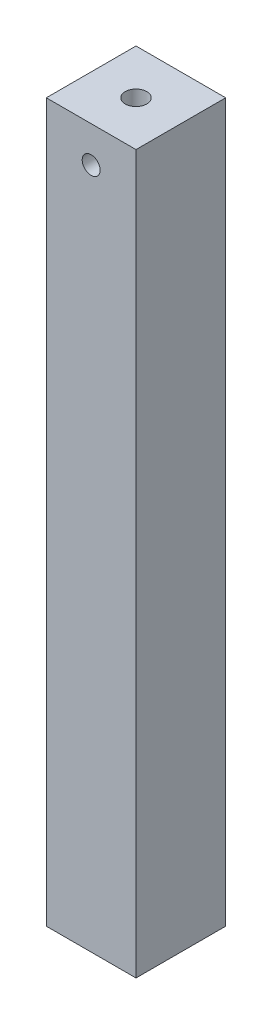
ISO-10303-21;
HEADER;
FILE_DESCRIPTION(('STEP AP214'),'2;1');
FILE_NAME('part.step','',(''),(''),'','','');
FILE_SCHEMA(('AUTOMOTIVE_DESIGN { 1 0 10303 214 1 1 1 1 }'));
ENDSEC;
DATA;
#1=APPLICATION_CONTEXT('core data for automotive mechanical design processes');
#2=APPLICATION_PROTOCOL_DEFINITION('international standard','automotive_design',2000,#1);
#3=PRODUCT_CONTEXT('',#1,'mechanical');
#4=PRODUCT('Part','Part','',(#3));
#5=PRODUCT_RELATED_PRODUCT_CATEGORY('part','',(#4));
#6=PRODUCT_DEFINITION_FORMATION('','',#4);
#7=PRODUCT_DEFINITION_CONTEXT('part definition',#1,'design');
#8=PRODUCT_DEFINITION('design','',#6,#7);
#9=PRODUCT_DEFINITION_SHAPE('','',#8);
#10=(LENGTH_UNIT() NAMED_UNIT(*) SI_UNIT(.MILLI.,.METRE.));
#11=(NAMED_UNIT(*) PLANE_ANGLE_UNIT() SI_UNIT($,.RADIAN.));
#12=(NAMED_UNIT(*) SI_UNIT($,.STERADIAN.) SOLID_ANGLE_UNIT());
#13=UNCERTAINTY_MEASURE_WITH_UNIT(LENGTH_MEASURE(1.E-05),#10,'distance_accuracy_value','');
#14=(GEOMETRIC_REPRESENTATION_CONTEXT(3) GLOBAL_UNCERTAINTY_ASSIGNED_CONTEXT((#13)) GLOBAL_UNIT_ASSIGNED_CONTEXT((#10,
#11,#12)) REPRESENTATION_CONTEXT('',''));
#15=CARTESIAN_POINT('',(0.,0.,0.));
#16=DIRECTION('',(0.,0.,1.));
#17=DIRECTION('',(1.,0.,0.));
#18=AXIS2_PLACEMENT_3D('',#15,#16,#17);
#19=CARTESIAN_POINT('',(0.,200.,0.));
#20=DIRECTION('',(0.,1.,0.));
#21=DIRECTION('',(0.,0.,1.));
#22=AXIS2_PLACEMENT_3D('',#19,#20,#21);
#23=PLANE('',#22);
#24=DIRECTION('',(0.,0.,-1.));
#25=VECTOR('',#24,1.);
#26=CARTESIAN_POINT('',(5.08620689655172,200.,14.8275862068966));
#27=LINE('',#26,#25);
#28=CARTESIAN_POINT('',(5.08620689655172,200.,14.8275862068966));
#29=VERTEX_POINT('',#28);
#30=CARTESIAN_POINT('',(5.08620689655172,200.,-10.1724137931034));
#31=VERTEX_POINT('',#30);
#32=EDGE_CURVE('E96',#29,#31,#27,.T.);
#33=ORIENTED_EDGE('',*,*,#32,.T.);
#34=DIRECTION('',(-1.,0.,0.));
#35=VECTOR('',#34,1.);
#36=CARTESIAN_POINT('',(5.08620689655172,200.,-10.1724137931034));
#37=LINE('',#36,#35);
#38=CARTESIAN_POINT('',(-19.9137931034483,200.,-10.1724137931034));
#39=VERTEX_POINT('',#38);
#40=EDGE_CURVE('E91',#31,#39,#37,.T.);
#41=ORIENTED_EDGE('',*,*,#40,.T.);
#42=DIRECTION('',(0.,0.,1.));
#43=VECTOR('',#42,1.);
#44=CARTESIAN_POINT('',(-19.9137931034483,200.,14.8275862068966));
#45=LINE('',#44,#43);
#46=CARTESIAN_POINT('',(-19.9137931034483,200.,14.8275862068966));
#47=VERTEX_POINT('',#46);
#48=EDGE_CURVE('E94',#39,#47,#45,.T.);
#49=ORIENTED_EDGE('',*,*,#48,.T.);
#50=DIRECTION('',(1.,0.,0.));
#51=VECTOR('',#50,1.);
#52=CARTESIAN_POINT('',(5.08620689655172,200.,14.8275862068966));
#53=LINE('',#52,#51);
#54=EDGE_CURVE('E61',#47,#29,#53,.T.);
#55=ORIENTED_EDGE('',*,*,#54,.T.);
#56=EDGE_LOOP('',(#33,#41,#49,#55));
#57=FACE_BOUND('',#56,.T.);
#58=CARTESIAN_POINT('',(-7.41379310344828,200.,2.32758620689655));
#59=DIRECTION('',(0.,1.,0.));
#60=DIRECTION('',(0.,0.,1.));
#61=AXIS2_PLACEMENT_3D('',#58,#59,#60);
#62=CIRCLE('',#61,3.);
#63=CARTESIAN_POINT('',(-7.41379310344828,200.,5.32758620689655));
#64=VERTEX_POINT('',#63);
#65=EDGE_CURVE('E112',#64,#64,#62,.T.);
#66=ORIENTED_EDGE('',*,*,#65,.F.);
#67=EDGE_LOOP('',(#66));
#68=FACE_BOUND('',#67,.T.);
#69=ADVANCED_FACE('F37',(#57,#68),#23,.T.);
#70=CARTESIAN_POINT('',(0.,0.,0.));
#71=DIRECTION('',(0.,1.,0.));
#72=DIRECTION('',(0.,0.,1.));
#73=AXIS2_PLACEMENT_3D('',#70,#71,#72);
#74=PLANE('',#73);
#75=DIRECTION('',(0.,0.,-1.));
#76=VECTOR('',#75,1.);
#77=CARTESIAN_POINT('',(5.08620689655172,0.,14.8275862068966));
#78=LINE('',#77,#76);
#79=CARTESIAN_POINT('',(5.08620689655172,0.,14.8275862068966));
#80=VERTEX_POINT('',#79);
#81=CARTESIAN_POINT('',(5.08620689655172,0.,-10.1724137931034));
#82=VERTEX_POINT('',#81);
#83=EDGE_CURVE('E109',#80,#82,#78,.T.);
#84=ORIENTED_EDGE('',*,*,#83,.F.);
#85=DIRECTION('',(1.,0.,0.));
#86=VECTOR('',#85,1.);
#87=CARTESIAN_POINT('',(5.08620689655172,0.,14.8275862068966));
#88=LINE('',#87,#86);
#89=CARTESIAN_POINT('',(-19.9137931034483,0.,14.8275862068966));
#90=VERTEX_POINT('',#89);
#91=EDGE_CURVE('E84',#90,#80,#88,.T.);
#92=ORIENTED_EDGE('',*,*,#91,.F.);
#93=DIRECTION('',(0.,0.,1.));
#94=VECTOR('',#93,1.);
#95=CARTESIAN_POINT('',(-19.9137931034483,0.,14.8275862068966));
#96=LINE('',#95,#94);
#97=CARTESIAN_POINT('',(-19.9137931034483,0.,-10.1724137931034));
#98=VERTEX_POINT('',#97);
#99=EDGE_CURVE('E78',#98,#90,#96,.T.);
#100=ORIENTED_EDGE('',*,*,#99,.F.);
#101=DIRECTION('',(-1.,0.,0.));
#102=VECTOR('',#101,1.);
#103=CARTESIAN_POINT('',(5.08620689655172,0.,-10.1724137931034));
#104=LINE('',#103,#102);
#105=EDGE_CURVE('E100',#82,#98,#104,.T.);
#106=ORIENTED_EDGE('',*,*,#105,.F.);
#107=EDGE_LOOP('',(#84,#92,#100,#106));
#108=FACE_BOUND('',#107,.T.);
#109=CARTESIAN_POINT('',(-7.41379310344828,0.,2.32758620689655));
#110=DIRECTION('',(0.,1.,0.));
#111=DIRECTION('',(0.,0.,1.));
#112=AXIS2_PLACEMENT_3D('',#109,#110,#111);
#113=CIRCLE('',#112,3.);
#114=CARTESIAN_POINT('',(-7.41379310344828,0.,5.32758620689655));
#115=VERTEX_POINT('',#114);
#116=EDGE_CURVE('E168',#115,#115,#113,.T.);
#117=ORIENTED_EDGE('',*,*,#116,.T.);
#118=EDGE_LOOP('',(#117));
#119=FACE_BOUND('',#118,.T.);
#120=ADVANCED_FACE('F141',(#108,#119),#74,.F.);
#121=CARTESIAN_POINT('',(5.08620689655172,200.,14.8275862068966));
#122=DIRECTION('',(-1.,0.,0.));
#123=DIRECTION('',(0.,0.,1.));
#124=AXIS2_PLACEMENT_3D('',#121,#122,#123);
#125=PLANE('',#124);
#126=ORIENTED_EDGE('',*,*,#83,.T.);
#127=DIRECTION('',(0.,-1.,0.));
#128=VECTOR('',#127,1.);
#129=CARTESIAN_POINT('',(5.08620689655172,200.,-10.1724137931034));
#130=LINE('',#129,#128);
#131=EDGE_CURVE('E11',#31,#82,#130,.T.);
#132=ORIENTED_EDGE('',*,*,#131,.F.);
#133=ORIENTED_EDGE('',*,*,#32,.F.);
#134=DIRECTION('',(0.,-1.,0.));
#135=VECTOR('',#134,1.);
#136=CARTESIAN_POINT('',(5.08620689655172,200.,14.8275862068966));
#137=LINE('',#136,#135);
#138=EDGE_CURVE('E105',#29,#80,#137,.T.);
#139=ORIENTED_EDGE('',*,*,#138,.T.);
#140=EDGE_LOOP('',(#126,#132,#133,#139));
#141=FACE_BOUND('',#140,.T.);
#142=ADVANCED_FACE('F39',(#141),#125,.F.);
#143=CARTESIAN_POINT('',(5.08620689655172,200.,-10.1724137931034));
#144=DIRECTION('',(0.,0.,1.));
#145=DIRECTION('',(1.,0.,0.));
#146=AXIS2_PLACEMENT_3D('',#143,#144,#145);
#147=PLANE('',#146);
#148=CARTESIAN_POINT('',(-7.41379310344828,190.,-10.1724137931034));
#149=DIRECTION('',(0.,0.,1.));
#150=DIRECTION('',(1.,0.,0.));
#151=AXIS2_PLACEMENT_3D('',#148,#149,#150);
#152=CIRCLE('',#151,2.5);
#153=CARTESIAN_POINT('',(-4.91379310344828,190.,-10.1724137931034));
#154=VERTEX_POINT('',#153);
#155=EDGE_CURVE('E122',#154,#154,#152,.T.);
#156=ORIENTED_EDGE('',*,*,#155,.T.);
#157=EDGE_LOOP('',(#156));
#158=FACE_BOUND('',#157,.T.);
#159=ORIENTED_EDGE('',*,*,#105,.T.);
#160=DIRECTION('',(0.,-1.,0.));
#161=VECTOR('',#160,1.);
#162=CARTESIAN_POINT('',(-19.9137931034483,200.,-10.1724137931034));
#163=LINE('',#162,#161);
#164=EDGE_CURVE('E52',#39,#98,#163,.T.);
#165=ORIENTED_EDGE('',*,*,#164,.F.);
#166=ORIENTED_EDGE('',*,*,#40,.F.);
#167=ORIENTED_EDGE('',*,*,#131,.T.);
#168=EDGE_LOOP('',(#159,#165,#166,#167));
#169=FACE_BOUND('',#168,.T.);
#170=ADVANCED_FACE('F99',(#158,#169),#147,.F.);
#171=CARTESIAN_POINT('',(-19.9137931034483,200.,14.8275862068966));
#172=DIRECTION('',(1.,0.,0.));
#173=DIRECTION('',(0.,0.,-1.));
#174=AXIS2_PLACEMENT_3D('',#171,#172,#173);
#175=PLANE('',#174);
#176=ORIENTED_EDGE('',*,*,#99,.T.);
#177=DIRECTION('',(0.,-1.,0.));
#178=VECTOR('',#177,1.);
#179=CARTESIAN_POINT('',(-19.9137931034483,200.,14.8275862068966));
#180=LINE('',#179,#178);
#181=EDGE_CURVE('E101',#47,#90,#180,.T.);
#182=ORIENTED_EDGE('',*,*,#181,.F.);
#183=ORIENTED_EDGE('',*,*,#48,.F.);
#184=ORIENTED_EDGE('',*,*,#164,.T.);
#185=EDGE_LOOP('',(#176,#182,#183,#184));
#186=FACE_BOUND('',#185,.T.);
#187=ADVANCED_FACE('F103',(#186),#175,.F.);
#188=CARTESIAN_POINT('',(5.08620689655172,200.,14.8275862068966));
#189=DIRECTION('',(0.,0.,-1.));
#190=DIRECTION('',(-1.,0.,0.));
#191=AXIS2_PLACEMENT_3D('',#188,#189,#190);
#192=PLANE('',#191);
#193=CARTESIAN_POINT('',(-7.41379310344828,190.,14.8275862068966));
#194=DIRECTION('',(0.,0.,1.));
#195=DIRECTION('',(1.,0.,0.));
#196=AXIS2_PLACEMENT_3D('',#193,#194,#195);
#197=CIRCLE('',#196,2.5);
#198=CARTESIAN_POINT('',(-4.91379310344828,190.,14.8275862068966));
#199=VERTEX_POINT('',#198);
#200=EDGE_CURVE('E161',#199,#199,#197,.T.);
#201=ORIENTED_EDGE('',*,*,#200,.F.);
#202=EDGE_LOOP('',(#201));
#203=FACE_BOUND('',#202,.T.);
#204=ORIENTED_EDGE('',*,*,#91,.T.);
#205=ORIENTED_EDGE('',*,*,#138,.F.);
#206=ORIENTED_EDGE('',*,*,#54,.F.);
#207=ORIENTED_EDGE('',*,*,#181,.T.);
#208=EDGE_LOOP('',(#204,#205,#206,#207));
#209=FACE_BOUND('',#208,.T.);
#210=ADVANCED_FACE('F137',(#203,#209),#192,.F.);
#211=CARTESIAN_POINT('',(-7.41379310344828,200.,2.32758620689655));
#212=DIRECTION('',(0.,-1.,0.));
#213=DIRECTION('',(0.,0.,-1.));
#214=AXIS2_PLACEMENT_3D('',#211,#212,#213);
#215=CYLINDRICAL_SURFACE('',#214,3.);
#216=CARTESIAN_POINT('',(-7.41379310344828,192.5,-0.672413793103448));
#217=CARTESIAN_POINT('',(-7.53255063664149,192.499995114446,-0.672409021055499));
#218=CARTESIAN_POINT('',(-7.65134438455241,192.491477496095,-0.665300499050873));
#219=CARTESIAN_POINT('',(-7.8849755959411,192.458037276648,-0.637521421786129));
#220=CARTESIAN_POINT('',(-7.9998100630607,192.433102526025,-0.616840822523522));
#221=CARTESIAN_POINT('',(-8.22162304585558,192.368687882667,-0.563840695492097));
#222=CARTESIAN_POINT('',(-8.32864402435318,192.329294925646,-0.531590758604145));
#223=CARTESIAN_POINT('',(-8.53363449388237,192.237982952057,-0.457705554932472));
#224=CARTESIAN_POINT('',(-8.63160091120062,192.186059703327,-0.41606711745281));
#225=CARTESIAN_POINT('',(-8.85169308864595,192.050546250192,-0.309155708402112));
#226=CARTESIAN_POINT('',(-8.96947530002048,191.962329795818,-0.240819285665361));
#227=CARTESIAN_POINT('',(-9.18581708672975,191.769475674249,-0.0966400408801867));
#228=CARTESIAN_POINT('',(-9.28432155503433,191.664792430757,-0.0207766076362126));
#229=CARTESIAN_POINT('',(-9.41816574150417,191.495915723509,0.0946373437591722));
#230=CARTESIAN_POINT('',(-9.46079036623644,191.437044423809,0.133749406946581));
#231=CARTESIAN_POINT('',(-9.54094605874383,191.31549439704,0.211380088804618));
#232=CARTESIAN_POINT('',(-9.57847542088568,191.252814405129,0.249898504946324));
#233=CARTESIAN_POINT('',(-9.64820432915575,191.123732675664,0.325080774009942));
#234=CARTESIAN_POINT('',(-9.68041643011055,191.057340215275,0.36174884935005));
#235=CARTESIAN_POINT('',(-9.73933000957621,190.920553716072,0.431809340593444));
#236=CARTESIAN_POINT('',(-9.76603618343509,190.850163152658,0.465204534687519));
#237=CARTESIAN_POINT('',(-9.81572824278834,190.6983329098,0.529667017092439));
#238=CARTESIAN_POINT('',(-9.83813118037427,190.616475907277,0.560223094386528));
#239=CARTESIAN_POINT('',(-9.87480624020331,190.448110231187,0.611654401336523));
#240=CARTESIAN_POINT('',(-9.88909809738621,190.361613413385,0.632553104954589));
#241=CARTESIAN_POINT('',(-9.90860383143877,190.184234591621,0.661376917208114));
#242=CARTESIAN_POINT('',(-9.91370515403496,190.093312040929,0.669141101265629));
#243=CARTESIAN_POINT('',(-9.91387879716019,189.911437386997,0.669403121578303));
#244=CARTESIAN_POINT('',(-9.90895098623233,189.820485283385,0.661900757727158));
#245=CARTESIAN_POINT('',(-9.88884572374423,189.634475289173,0.632169812251583));
#246=CARTESIAN_POINT('',(-9.87284887458161,189.539706254283,0.608766886231891));
#247=CARTESIAN_POINT('',(-9.83121860847857,189.355789018798,0.550703849507428));
#248=CARTESIAN_POINT('',(-9.80555321389119,189.266660629285,0.516006435866321));
#249=CARTESIAN_POINT('',(-9.75195580691703,189.112172921459,0.4475639456352));
#250=CARTESIAN_POINT('',(-9.72556823378396,189.045687757588,0.415083038442183));
#251=CARTESIAN_POINT('',(-9.66783735303467,188.91634919322,0.34736624028128));
#252=CARTESIAN_POINT('',(-9.63649113931136,188.853497952134,0.31212873991872));
#253=CARTESIAN_POINT('',(-9.53528987905296,188.67003315898,0.204159725799331));
#254=CARTESIAN_POINT('',(-9.45829974576607,188.554585852394,0.129209237222191));
#255=CARTESIAN_POINT('',(-9.28145224846245,188.331733037546,-0.0232127726262048));
#256=CARTESIAN_POINT('',(-9.1806111562246,188.225061676008,-0.100611719292871));
#257=CARTESIAN_POINT('',(-8.95863698680981,188.028887655183,-0.247504333536274));
#258=CARTESIAN_POINT('',(-8.83754875960606,187.939347966944,-0.317014915777064));
#259=CARTESIAN_POINT('',(-8.60790489514249,187.800585160901,-0.426702934368902));
#260=CARTESIAN_POINT('',(-8.5035204245211,187.746857101812,-0.469897293843384));
#261=CARTESIAN_POINT('',(-8.2848645617787,187.653657254745,-0.545491833301447));
#262=CARTESIAN_POINT('',(-8.17059939622909,187.614176568419,-0.577898749711486));
#263=CARTESIAN_POINT('',(-7.93374740466374,187.551582750068,-0.629512135759093));
#264=CARTESIAN_POINT('',(-7.81110402657363,187.528596053342,-0.648616602661886));
#265=CARTESIAN_POINT('',(-7.56235308037205,187.501290768073,-0.671328138393167));
#266=CARTESIAN_POINT('',(-7.43624788697232,187.49695968915,-0.674945576145219));
#267=CARTESIAN_POINT('',(-7.20048290399174,187.506662439444,-0.666863783494919));
#268=CARTESIAN_POINT('',(-7.09066256261246,187.518558638715,-0.656947300266578));
#269=CARTESIAN_POINT('',(-6.87514813904771,187.556266950211,-0.625669687704807));
#270=CARTESIAN_POINT('',(-6.76945455345875,187.582080731719,-0.604307185531413));
#271=CARTESIAN_POINT('',(-6.56322760424906,187.646623395455,-0.551309008565317));
#272=CARTESIAN_POINT('',(-6.462782421225,187.685520789444,-0.519539442023202));
#273=CARTESIAN_POINT('',(-6.27013409446728,187.774395632337,-0.447775040442355));
#274=CARTESIAN_POINT('',(-6.17793401513621,187.824377176993,-0.407777165321542));
#275=CARTESIAN_POINT('',(-5.96311870609732,187.958431795347,-0.302165314689403));
#276=CARTESIAN_POINT('',(-5.845449508041,188.047732583267,-0.233116235450606));
#277=CARTESIAN_POINT('',(-5.62950315603984,188.242840382656,-0.0876382471353766));
#278=CARTESIAN_POINT('',(-5.53128819489659,188.348698455355,-0.011186797331821));
#279=CARTESIAN_POINT('',(-5.39805995560541,188.519411967929,0.10488815091052));
#280=CARTESIAN_POINT('',(-5.35568241200882,188.578898272976,0.144174689536229));
#281=CARTESIAN_POINT('',(-5.27607640747424,188.701720816032,0.22205466872472));
#282=CARTESIAN_POINT('',(-5.23884979938075,188.765058427664,0.260647855560463));
#283=CARTESIAN_POINT('',(-5.16980453318073,188.895488403915,0.335825122070136));
#284=CARTESIAN_POINT('',(-5.13797161563293,188.962570224534,0.372414320554412));
#285=CARTESIAN_POINT('',(-5.07990453605371,189.1007901045,0.44211059241474));
#286=CARTESIAN_POINT('',(-5.05366524360175,189.171924370419,0.475220842388624));
#287=CARTESIAN_POINT('',(-5.00541953196508,189.324270368352,0.538330632736062));
#288=CARTESIAN_POINT('',(-4.98390996026285,189.405834451074,0.567879089030006));
#289=CARTESIAN_POINT('',(-4.94897054655315,189.573451953943,0.617155568022281));
#290=CARTESIAN_POINT('',(-4.93552052631472,189.659493571328,0.63690809464396));
#291=CARTESIAN_POINT('',(-4.91762020809565,189.835637607412,0.663433047101954));
#292=CARTESIAN_POINT('',(-4.91327511160868,189.925775329751,0.67005369641264));
#293=CARTESIAN_POINT('',(-4.91441113240373,190.105853212784,0.668343120589891));
#294=CARTESIAN_POINT('',(-4.91989484070816,190.195793315125,0.660007952875011));
#295=CARTESIAN_POINT('',(-4.94114046496288,190.381672575391,0.628657219541359));
#296=CARTESIAN_POINT('',(-4.95793497794067,190.477230270533,0.604172496657971));
#297=CARTESIAN_POINT('',(-5.00128970669738,190.662531296083,0.543998926522677));
#298=CARTESIAN_POINT('',(-5.0278822205892,190.752254228709,0.508273081583283));
#299=CARTESIAN_POINT('',(-5.08328474499911,190.907789041355,0.438060013234598));
#300=CARTESIAN_POINT('',(-5.11053457295299,190.974743759235,0.404808040618625));
#301=CARTESIAN_POINT('',(-5.17008683326818,191.104946386424,0.335634354590826));
#302=CARTESIAN_POINT('',(-5.20239220323966,191.168192111,0.299711095391336));
#303=CARTESIAN_POINT('',(-5.30663015915845,191.352729561342,0.189826895217409));
#304=CARTESIAN_POINT('',(-5.38585733601079,191.468746924992,0.113788405253335));
#305=CARTESIAN_POINT('',(-5.56749612777417,191.692007261291,-0.0401398307389262));
#306=CARTESIAN_POINT('',(-5.6708535075155,191.798541794033,-0.117937737398588));
#307=CARTESIAN_POINT('',(-5.8982575540921,191.993863799539,-0.264978777381008));
#308=CARTESIAN_POINT('',(-6.02225726681616,192.082690565874,-0.33424071853414));
#309=CARTESIAN_POINT('',(-6.25523792203748,192.218314196723,-0.441836850918543));
#310=CARTESIAN_POINT('',(-6.35979432397137,192.270038510219,-0.483535533172282));
#311=CARTESIAN_POINT('',(-6.57835331739395,192.359218670239,-0.556028399767979));
#312=CARTESIAN_POINT('',(-6.6923430766944,192.396693524095,-0.586837106341152));
#313=CARTESIAN_POINT('',(-6.90717306456145,192.450188455827,-0.631001252150356));
#314=CARTESIAN_POINT('',(-7.00694763468638,192.468775122227,-0.646435217084556));
#315=CARTESIAN_POINT('',(-7.20907037779405,192.493682368238,-0.66714302104753));
#316=CARTESIAN_POINT('',(-7.3114182845255,192.500004211587,-0.67241790684286));
#317=CARTESIAN_POINT('',(-7.41379310344828,192.5,-0.672413793103448));
#318=B_SPLINE_CURVE_WITH_KNOTS('',3,(#216,#217,#218,#219,#220,#221,#222,#223,#224,#225,#226,
#227,#228,#229,#230,#231,#232,#233,#234,#235,#236,#237,#238,#239,#240,#241,#242,#243,#244,#245,
#246,#247,#248,#249,#250,#251,#252,#253,#254,#255,#256,#257,#258,#259,#260,#261,#262,#263,#264,
#265,#266,#267,#268,#269,#270,#271,#272,#273,#274,#275,#276,#277,#278,#279,#280,#281,#282,#283,
#284,#285,#286,#287,#288,#289,#290,#291,#292,#293,#294,#295,#296,#297,#298,#299,#300,#301,#302,
#303,#304,#305,#306,#307,#308,#309,#310,#311,#312,#313,#314,#315,#316,#317),.UNSPECIFIED.,.T.,
.F.,(4,2,2,2,2,2,2,2,2,2,2,2,2,2,2,2,2,2,2,2,2,2,2,2,2,2,2,2,2,2,2,2,2,2,2,2,2,2,2,2,2,2,2,2,2,
2,2,2,2,2,4),(0.,0.355841276815114,0.71194619102696,1.06594405359551,1.42006164830116,
1.90425178760126,2.38980643116775,2.63722280423448,2.88472179650724,3.13162777943677,
3.37832232674677,3.64812890035755,3.91727616616871,4.18969776924976,4.46212294312048,
4.75723524199721,5.05333228584566,5.28870178855689,5.5242097486863,5.99549339358978,
6.49137310548266,6.98616858956862,7.36002155957571,7.73364063000472,8.11009395319718,
8.48629519274358,8.81743460677924,9.14861374669869,9.48423297747604,9.81997643164431,
10.3065635514456,10.7946819775667,11.0432812121088,11.2919696391638,11.5399899810636,
11.7877818528619,12.0551105531685,12.3217671309317,12.5914881373799,12.8612802568452,
13.1598101383752,13.4593330283462,13.6977271411688,13.936260294913,14.4135864576439,
14.9143001108861,15.4138899995711,15.7841228897599,16.1538601797497,16.4606444271244,
16.7673970625124),.UNSPECIFIED.);
#319=CARTESIAN_POINT('',(-7.41379310344828,192.5,-0.672413793103448));
#320=VERTEX_POINT('',#319);
#321=EDGE_CURVE('E41',#320,#320,#318,.T.);
#322=ORIENTED_EDGE('',*,*,#321,.F.);
#323=EDGE_LOOP('',(#322));
#324=FACE_BOUND('',#323,.T.);
#325=CARTESIAN_POINT('',(-4.91379310344828,190.,3.98589860207425));
#326=CARTESIAN_POINT('',(-4.91379928565571,189.911695589814,3.98591469217432));
#327=CARTESIAN_POINT('',(-4.91853044338004,189.82324021399,3.99310727557415));
#328=CARTESIAN_POINT('',(-4.93696320224956,189.649222116097,4.02038248253912));
#329=CARTESIAN_POINT('',(-4.95069562822663,189.563670400315,4.04050939504288));
#330=CARTESIAN_POINT('',(-4.99292454224126,189.364894689358,4.09991736368265));
#331=CARTESIAN_POINT('',(-5.02508164221001,189.253808345513,4.1435998026888));
#332=CARTESIAN_POINT('',(-5.10232207843052,189.040822183425,4.24095387891099));
#333=CARTESIAN_POINT('',(-5.14744724005872,188.938953515347,4.29465763773517));
#334=CARTESIAN_POINT('',(-5.23531875029289,188.770954385988,4.39089901028566));
#335=CARTESIAN_POINT('',(-5.27526415125539,188.702738408645,4.43241108874668));
#336=CARTESIAN_POINT('',(-5.36114892157627,188.570712899603,4.51625265182022));
#337=CARTESIAN_POINT('',(-5.40709086625936,188.506905279262,4.55858248093751));
#338=CARTESIAN_POINT('',(-5.55373133135333,188.322243232396,4.6848600883325));
#339=CARTESIAN_POINT('',(-5.66339488026191,188.207863367576,4.76827052366636));
#340=CARTESIAN_POINT('',(-5.88048074249557,188.021405994211,4.90866985101304));
#341=CARTESIAN_POINT('',(-5.98344446850431,187.94550177742,4.9675102981171));
#342=CARTESIAN_POINT('',(-6.20352003847793,187.808662942608,5.07534410973659));
#343=CARTESIAN_POINT('',(-6.32060850088944,187.747704078489,5.12435339969809));
#344=CARTESIAN_POINT('',(-6.54586252934289,187.652887134927,5.20131544480118));
#345=CARTESIAN_POINT('',(-6.65207254448042,187.616166035344,5.23144351420505));
#346=CARTESIAN_POINT('',(-6.87095893843917,187.557019590314,5.28019003306007));
#347=CARTESIAN_POINT('',(-6.98363154972208,187.534586006092,5.2988151154228));
#348=CARTESIAN_POINT('',(-7.21288690577851,187.505398504355,5.32307780887534));
#349=CARTESIAN_POINT('',(-7.32948396080174,187.498710170252,5.32866109646062));
#350=CARTESIAN_POINT('',(-7.5623204971094,187.501702245115,5.32616764219337));
#351=CARTESIAN_POINT('',(-7.67855998625805,187.511382291462,5.31809120295306));
#352=CARTESIAN_POINT('',(-7.89923913477094,187.545214249544,5.2899995666302));
#353=CARTESIAN_POINT('',(-8.00394710898276,187.568351117846,5.27082215205825));
#354=CARTESIAN_POINT('',(-8.20741936030231,187.626947831232,5.22259933048552));
#355=CARTESIAN_POINT('',(-8.30618278239764,187.662409444055,5.19355250792889));
#356=CARTESIAN_POINT('',(-8.50432674980271,187.747591171451,5.12448926149387));
#357=CARTESIAN_POINT('',(-8.60303685272564,187.798271769164,5.08374682613104));
#358=CARTESIAN_POINT('',(-8.79057228319389,187.910396692937,4.9950338321703));
#359=CARTESIAN_POINT('',(-8.87938860798146,187.971850693412,4.94705678241774));
#360=CARTESIAN_POINT('',(-9.08659691624559,188.135459324474,4.82207410081002));
#361=CARTESIAN_POINT('',(-9.19896727875309,188.243071223398,4.74211404546479));
#362=CARTESIAN_POINT('',(-9.35049497965685,188.417240302723,4.61962566058516));
#363=CARTESIAN_POINT('',(-9.39822044760574,188.477514168307,4.57831252586893));
#364=CARTESIAN_POINT('',(-9.48798004643256,188.602271785489,4.49586996676134));
#365=CARTESIAN_POINT('',(-9.5300162236271,188.666754010995,4.45474048148991));
#366=CARTESIAN_POINT('',(-9.62662143471316,188.831118604474,4.35494634611229));
#367=CARTESIAN_POINT('',(-9.67786882255593,188.933463599434,4.29706802347656));
#368=CARTESIAN_POINT('',(-9.76693360430595,189.147861171537,4.18972474356364));
#369=CARTESIAN_POINT('',(-9.80478910650757,189.259885055627,4.14023612507478));
#370=CARTESIAN_POINT('',(-9.85520399885439,189.455820452512,4.07135228350363));
#371=CARTESIAN_POINT('',(-9.87198668509794,189.536998750283,4.04740569947059));
#372=CARTESIAN_POINT('',(-9.89749583566978,189.702961145675,4.01036289494223));
#373=CARTESIAN_POINT('',(-9.90624124436725,189.787736268895,3.9972411670979));
#374=CARTESIAN_POINT('',(-9.91494827731843,189.95942770657,3.9841793077161));
#375=CARTESIAN_POINT('',(-9.91484647709319,190.046355014667,3.98433435552348));
#376=CARTESIAN_POINT('',(-9.90570907617354,190.218705687514,3.99803764135442));
#377=CARTESIAN_POINT('',(-9.89666110530547,190.30412680313,4.01160442423441));
#378=CARTESIAN_POINT('',(-9.86715356462208,190.492184457339,4.05438506728143));
#379=CARTESIAN_POINT('',(-9.84439027809819,190.593724968505,4.08668375798866));
#380=CARTESIAN_POINT('',(-9.78801878328339,190.789632446399,4.16204917846435));
#381=CARTESIAN_POINT('',(-9.75437473485606,190.883974414693,4.20515138688882));
#382=CARTESIAN_POINT('',(-9.68576774440476,191.045994783293,4.28727030279781));
#383=CARTESIAN_POINT('',(-9.65264259924796,191.115045739748,4.32517387329906));
#384=CARTESIAN_POINT('',(-9.58075261511771,191.249028497208,4.40293936992737));
#385=CARTESIAN_POINT('',(-9.54198486408741,191.313958146274,4.4428023001697));
#386=CARTESIAN_POINT('',(-9.45892487801752,191.439833905827,4.52321349646723));
#387=CARTESIAN_POINT('',(-9.41462813177318,191.500776700764,4.56376229851078));
#388=CARTESIAN_POINT('',(-9.32058944284134,191.618584949101,4.64447689621241));
#389=CARTESIAN_POINT('',(-9.27084467595517,191.675448262218,4.68464248137464));
#390=CARTESIAN_POINT('',(-9.11070781139462,191.842454835183,4.80519746733594));
#391=CARTESIAN_POINT('',(-8.99142180046896,191.945937538719,4.88359756110051));
#392=CARTESIAN_POINT('',(-8.79593143774555,192.084720633061,4.99127615511933));
#393=CARTESIAN_POINT('',(-8.72807454596811,192.128210529514,5.02548974353961));
#394=CARTESIAN_POINT('',(-8.58699877655759,192.209116741034,5.08975664967191));
#395=CARTESIAN_POINT('',(-8.51378311031847,192.246536651153,5.11981242835376));
#396=CARTESIAN_POINT('',(-8.33702445315066,192.325917349644,5.18401386676821));
#397=CARTESIAN_POINT('',(-8.23152301006775,192.365216824066,5.216169868349));
#398=CARTESIAN_POINT('',(-8.01359063635868,192.429636248251,5.26914971221139));
#399=CARTESIAN_POINT('',(-7.90116517557671,192.454767235438,5.2899823750581));
#400=CARTESIAN_POINT('',(-7.67169711803778,192.489377151845,5.31872375469009));
#401=CARTESIAN_POINT('',(-7.55463502569876,192.498780715084,5.32657023971322));
#402=CARTESIAN_POINT('',(-7.32024266653011,192.500995631528,5.32841579753759));
#403=CARTESIAN_POINT('',(-7.20291241991092,192.493808196491,5.32241588163768));
#404=CARTESIAN_POINT('',(-6.98031410423431,192.464504952981,5.29806192810257));
#405=CARTESIAN_POINT('',(-6.87478972160735,192.443513963241,5.28063902017943));
#406=CARTESIAN_POINT('',(-6.66935087682544,192.388956147736,5.23565678198547));
#407=CARTESIAN_POINT('',(-6.56943729476026,192.355387355363,5.20809586659434));
#408=CARTESIAN_POINT('',(-6.36995255191843,192.274382844718,5.14222964553099));
#409=CARTESIAN_POINT('',(-6.27093137490822,192.226118227895,5.10329024433227));
#410=CARTESIAN_POINT('',(-6.08244213043604,192.118795067117,5.01798421361614));
#411=CARTESIAN_POINT('',(-5.99298151336665,192.059728200927,4.97161186105548));
#412=CARTESIAN_POINT('',(-5.78376752252885,191.901956252374,4.85023471718323));
#413=CARTESIAN_POINT('',(-5.66988798399779,191.797773643251,4.77211441161991));
#414=CARTESIAN_POINT('',(-5.51571579359812,191.628846270724,4.65171952631496));
#415=CARTESIAN_POINT('',(-5.46703775444767,191.570328699502,4.61098719198148));
#416=CARTESIAN_POINT('',(-5.37523831691622,191.449158530274,4.52941689136479));
#417=CARTESIAN_POINT('',(-5.33211520848123,191.386507213843,4.48857896155657));
#418=CARTESIAN_POINT('',(-5.22869721775128,191.220508311488,4.38508356490091));
#419=CARTESIAN_POINT('',(-5.17245624472603,191.114157651654,4.32312682974765));
#420=CARTESIAN_POINT('',(-5.07469675354503,190.89074431529,4.20756255951688));
#421=CARTESIAN_POINT('',(-5.03313813841407,190.773711928944,4.15393251293619));
#422=CARTESIAN_POINT('',(-4.97822815352717,190.570125763537,4.07955727811387));
#423=CARTESIAN_POINT('',(-4.96009048587649,190.486726207798,4.05382999878682));
#424=CARTESIAN_POINT('',(-4.93234872590271,190.315972131174,4.0137204669159));
#425=CARTESIAN_POINT('',(-4.92271181097881,190.228634203067,3.99929460239143));
#426=CARTESIAN_POINT('',(-4.91643149508134,190.117208675187,3.98986978689978));
#427=CARTESIAN_POINT('',(-4.91544383704023,190.093807175124,3.98838507495194));
#428=CARTESIAN_POINT('',(-4.91412375830815,190.046940680608,3.98639725216322));
#429=CARTESIAN_POINT('',(-4.9137914599121,190.023475675121,3.98589432453068));
#430=CARTESIAN_POINT('',(-4.91379310344828,190.,3.98589860207425));
#431=B_SPLINE_CURVE_WITH_KNOTS('',3,(#325,#326,#327,#328,#329,#330,#331,#332,#333,#334,#335,
#336,#337,#338,#339,#340,#341,#342,#343,#344,#345,#346,#347,#348,#349,#350,#351,#352,#353,#354,
#355,#356,#357,#358,#359,#360,#361,#362,#363,#364,#365,#366,#367,#368,#369,#370,#371,#372,#373,
#374,#375,#376,#377,#378,#379,#380,#381,#382,#383,#384,#385,#386,#387,#388,#389,#390,#391,#392,
#393,#394,#395,#396,#397,#398,#399,#400,#401,#402,#403,#404,#405,#406,#407,#408,#409,#410,#411,
#412,#413,#414,#415,#416,#417,#418,#419,#420,#421,#422,#423,#424,#425,#426,#427,#428,#429,#430),
.UNSPECIFIED.,.T.,.F.,(4,2,2,2,2,2,2,2,2,2,2,2,2,2,2,2,2,2,2,2,2,2,2,2,2,2,2,2,2,2,2,2,2,2,2,2,
2,2,2,2,2,2,2,2,2,2,2,2,2,2,2,2,4),(0.,0.264807486843923,0.530526577859122,0.899311711113922,
1.26929988428699,1.53684271887078,1.80450083499519,2.33872733232389,2.75963734355724,
3.17985991852659,3.52745225260406,3.87484396861121,4.22368012855142,4.5725085606138,
4.89792180788534,5.22338174845527,5.5766929274981,5.93032301720756,6.45212646169821,
6.71375344417643,6.975286073498,7.35902155845302,7.7416561218646,7.99961659145738,
8.25696746076721,8.51616339578942,8.77571823174389,9.10077852677667,9.42692063321699,
9.68296205217757,9.93913608157881,10.1955205112228,10.4520384827407,10.9775613091595,
11.2398627749287,11.502008316419,11.8517559716833,12.201230791394,12.5523755496757,
12.903494662228,13.2290536025831,13.5546634671053,13.903879771412,14.2533662599301,
14.7693582552692,15.0281495003973,15.2868608867407,15.6916620845259,16.0953490806584,
16.3618811606765,16.6273795605045,16.697765340701,16.7681642541596),.UNSPECIFIED.);
#432=CARTESIAN_POINT('',(-4.91379310344828,190.,3.98589860207425));
#433=VERTEX_POINT('',#432);
#434=EDGE_CURVE('E117',#433,#433,#431,.T.);
#435=ORIENTED_EDGE('',*,*,#434,.F.);
#436=EDGE_LOOP('',(#435));
#437=FACE_BOUND('',#436,.T.);
#438=ORIENTED_EDGE('',*,*,#65,.T.);
#439=EDGE_LOOP('',(#438));
#440=FACE_BOUND('',#439,.T.);
#441=ORIENTED_EDGE('',*,*,#116,.F.);
#442=EDGE_LOOP('',(#441));
#443=FACE_BOUND('',#442,.T.);
#444=ADVANCED_FACE('F123',(#324,#437,#440,#443),#215,.F.);
#445=CARTESIAN_POINT('',(-7.41379310344828,190.,-10.1724137931034));
#446=DIRECTION('',(0.,0.,1.));
#447=DIRECTION('',(1.,0.,0.));
#448=AXIS2_PLACEMENT_3D('',#445,#446,#447);
#449=CYLINDRICAL_SURFACE('',#448,2.5);
#450=ORIENTED_EDGE('',*,*,#434,.T.);
#451=EDGE_LOOP('',(#450));
#452=FACE_BOUND('',#451,.T.);
#453=ORIENTED_EDGE('',*,*,#200,.T.);
#454=EDGE_LOOP('',(#453));
#455=FACE_BOUND('',#454,.T.);
#456=ADVANCED_FACE('F126',(#452,#455),#449,.F.);
#457=ORIENTED_EDGE('',*,*,#321,.T.);
#458=EDGE_LOOP('',(#457));
#459=FACE_BOUND('',#458,.T.);
#460=ORIENTED_EDGE('',*,*,#155,.F.);
#461=EDGE_LOOP('',(#460));
#462=FACE_BOUND('',#461,.T.);
#463=ADVANCED_FACE('F129',(#459,#462),#449,.F.);
#464=CLOSED_SHELL('',(#69,#120,#142,#170,#187,#210,#444,#456,#463));
#465=MANIFOLD_SOLID_BREP('B2',#464);
#466=ADVANCED_BREP_SHAPE_REPRESENTATION('',(#18,#465),#14);
#467=SHAPE_DEFINITION_REPRESENTATION(#9,#466);
ENDSEC;
END-ISO-10303-21;
